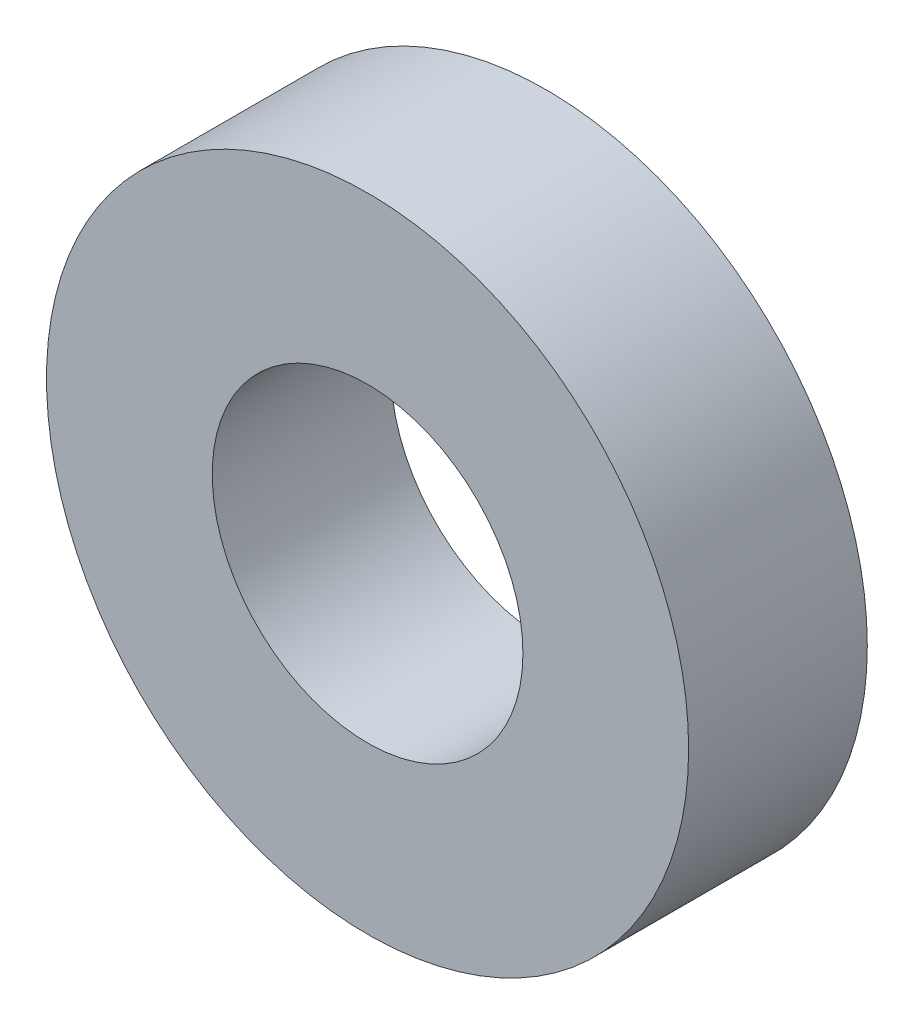
ISO-10303-21;
HEADER;
FILE_DESCRIPTION(('STEP AP214'),'2;1');
FILE_NAME('part.step','',(''),(''),'','','');
FILE_SCHEMA(('AUTOMOTIVE_DESIGN { 1 0 10303 214 1 1 1 1 }'));
ENDSEC;
DATA;
#1=APPLICATION_CONTEXT('core data for automotive mechanical design processes');
#2=APPLICATION_PROTOCOL_DEFINITION('international standard','automotive_design',2000,#1);
#3=PRODUCT_CONTEXT('',#1,'mechanical');
#4=PRODUCT('Part','Part','',(#3));
#5=PRODUCT_RELATED_PRODUCT_CATEGORY('part','',(#4));
#6=PRODUCT_DEFINITION_FORMATION('','',#4);
#7=PRODUCT_DEFINITION_CONTEXT('part definition',#1,'design');
#8=PRODUCT_DEFINITION('design','',#6,#7);
#9=PRODUCT_DEFINITION_SHAPE('','',#8);
#10=(LENGTH_UNIT() NAMED_UNIT(*) SI_UNIT(.MILLI.,.METRE.));
#11=(NAMED_UNIT(*) PLANE_ANGLE_UNIT() SI_UNIT($,.RADIAN.));
#12=(NAMED_UNIT(*) SI_UNIT($,.STERADIAN.) SOLID_ANGLE_UNIT());
#13=UNCERTAINTY_MEASURE_WITH_UNIT(LENGTH_MEASURE(1.E-05),#10,'distance_accuracy_value','');
#14=(GEOMETRIC_REPRESENTATION_CONTEXT(3) GLOBAL_UNCERTAINTY_ASSIGNED_CONTEXT((#13)) GLOBAL_UNIT_ASSIGNED_CONTEXT((#10,
#11,#12)) REPRESENTATION_CONTEXT('',''));
#15=CARTESIAN_POINT('',(0.,0.,0.));
#16=DIRECTION('',(0.,0.,1.));
#17=DIRECTION('',(1.,0.,0.));
#18=AXIS2_PLACEMENT_3D('',#15,#16,#17);
#19=CARTESIAN_POINT('',(0.,5.55184041887712,-9.15130778880056));
#20=DIRECTION('',(0.,0.,-1.));
#21=DIRECTION('',(-1.,0.,0.));
#22=AXIS2_PLACEMENT_3D('',#19,#20,#21);
#23=PLANE('',#22);
#24=CARTESIAN_POINT('',(0.,0.,-9.15130778880056));
#25=DIRECTION('',(0.,0.,1.));
#26=DIRECTION('',(1.,0.,0.));
#27=AXIS2_PLACEMENT_3D('',#24,#25,#26);
#28=CIRCLE('',#27,15.);
#29=CARTESIAN_POINT('',(15.,0.,-9.15130778880056));
#30=VERTEX_POINT('',#29);
#31=EDGE_CURVE('E45',#30,#30,#28,.T.);
#32=ORIENTED_EDGE('',*,*,#31,.T.);
#33=EDGE_LOOP('',(#32));
#34=FACE_BOUND('',#33,.T.);
#35=CARTESIAN_POINT('',(0.,0.,-9.15130778880056));
#36=DIRECTION('',(0.,0.,1.));
#37=DIRECTION('',(1.,0.,0.));
#38=AXIS2_PLACEMENT_3D('',#35,#36,#37);
#39=CIRCLE('',#38,31.);
#40=CARTESIAN_POINT('',(31.,0.,-9.15130778880056));
#41=VERTEX_POINT('',#40);
#42=EDGE_CURVE('E10',#41,#41,#39,.T.);
#43=ORIENTED_EDGE('',*,*,#42,.F.);
#44=EDGE_LOOP('',(#43));
#45=FACE_BOUND('',#44,.T.);
#46=ADVANCED_FACE('F31',(#34,#45),#23,.T.);
#47=CARTESIAN_POINT('',(0.,0.,27.3689927627821));
#48=DIRECTION('',(0.,0.,1.));
#49=DIRECTION('',(1.,0.,0.));
#50=AXIS2_PLACEMENT_3D('',#47,#48,#49);
#51=CYLINDRICAL_SURFACE('',#50,31.);
#52=ORIENTED_EDGE('',*,*,#42,.T.);
#53=EDGE_LOOP('',(#52));
#54=FACE_BOUND('',#53,.T.);
#55=CARTESIAN_POINT('',(0.,0.,8.09869221119944));
#56=DIRECTION('',(0.,0.,1.));
#57=DIRECTION('',(1.,0.,0.));
#58=AXIS2_PLACEMENT_3D('',#55,#56,#57);
#59=CIRCLE('',#58,31.);
#60=CARTESIAN_POINT('',(31.,0.,8.09869221119944));
#61=VERTEX_POINT('',#60);
#62=EDGE_CURVE('E37',#61,#61,#59,.T.);
#63=ORIENTED_EDGE('',*,*,#62,.F.);
#64=EDGE_LOOP('',(#63));
#65=FACE_BOUND('',#64,.T.);
#66=ADVANCED_FACE('F61',(#54,#65),#51,.T.);
#67=CARTESIAN_POINT('',(0.,5.55184041887712,8.09869221119944));
#68=DIRECTION('',(0.,0.,-1.));
#69=DIRECTION('',(-1.,0.,0.));
#70=AXIS2_PLACEMENT_3D('',#67,#68,#69);
#71=PLANE('',#70);
#72=CARTESIAN_POINT('',(0.,0.,8.09869221119944));
#73=DIRECTION('',(0.,0.,1.));
#74=DIRECTION('',(1.,0.,0.));
#75=AXIS2_PLACEMENT_3D('',#72,#73,#74);
#76=CIRCLE('',#75,15.);
#77=CARTESIAN_POINT('',(15.,0.,8.09869221119944));
#78=VERTEX_POINT('',#77);
#79=EDGE_CURVE('E41',#78,#78,#76,.T.);
#80=ORIENTED_EDGE('',*,*,#79,.F.);
#81=EDGE_LOOP('',(#80));
#82=FACE_BOUND('',#81,.T.);
#83=ORIENTED_EDGE('',*,*,#62,.T.);
#84=EDGE_LOOP('',(#83));
#85=FACE_BOUND('',#84,.T.);
#86=ADVANCED_FACE('F56',(#82,#85),#71,.F.);
#87=CARTESIAN_POINT('',(0.,0.,27.3689927627821));
#88=DIRECTION('',(0.,0.,1.));
#89=DIRECTION('',(1.,0.,0.));
#90=AXIS2_PLACEMENT_3D('',#87,#88,#89);
#91=CYLINDRICAL_SURFACE('',#90,15.);
#92=ORIENTED_EDGE('',*,*,#31,.F.);
#93=EDGE_LOOP('',(#92));
#94=FACE_BOUND('',#93,.T.);
#95=ORIENTED_EDGE('',*,*,#79,.T.);
#96=EDGE_LOOP('',(#95));
#97=FACE_BOUND('',#96,.T.);
#98=ADVANCED_FACE('F53',(#94,#97),#91,.F.);
#99=CLOSED_SHELL('',(#46,#66,#86,#98));
#100=MANIFOLD_SOLID_BREP('B2',#99);
#101=ADVANCED_BREP_SHAPE_REPRESENTATION('',(#18,#100),#14);
#102=SHAPE_DEFINITION_REPRESENTATION(#9,#101);
ENDSEC;
END-ISO-10303-21;
